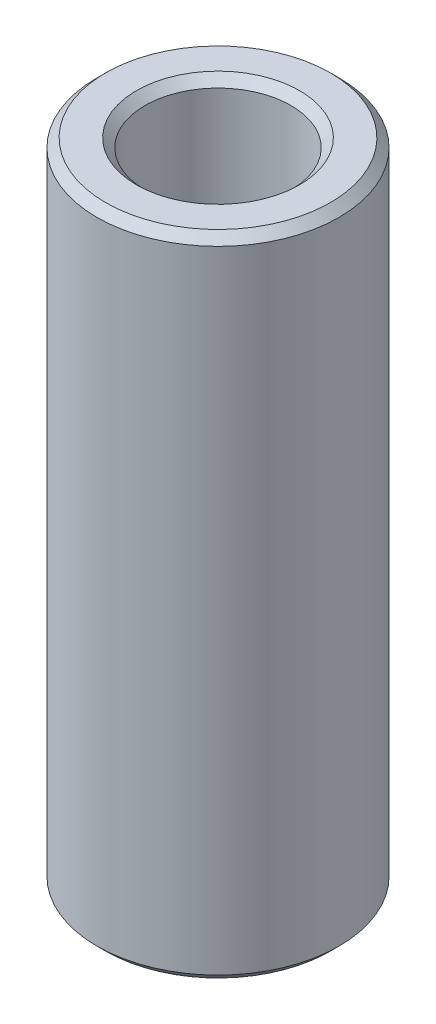
ISO-10303-21;
HEADER;
FILE_DESCRIPTION(('STEP AP214'),'2;1');
FILE_NAME('part.step','',(''),(''),'','','');
FILE_SCHEMA(('AUTOMOTIVE_DESIGN { 1 0 10303 214 1 1 1 1 }'));
ENDSEC;
DATA;
#1=APPLICATION_CONTEXT('core data for automotive mechanical design processes');
#2=APPLICATION_PROTOCOL_DEFINITION('international standard','automotive_design',2000,#1);
#3=PRODUCT_CONTEXT('',#1,'mechanical');
#4=PRODUCT('Part','Part','',(#3));
#5=PRODUCT_RELATED_PRODUCT_CATEGORY('part','',(#4));
#6=PRODUCT_DEFINITION_FORMATION('','',#4);
#7=PRODUCT_DEFINITION_CONTEXT('part definition',#1,'design');
#8=PRODUCT_DEFINITION('design','',#6,#7);
#9=PRODUCT_DEFINITION_SHAPE('','',#8);
#10=(LENGTH_UNIT() NAMED_UNIT(*) SI_UNIT(.MILLI.,.METRE.));
#11=(NAMED_UNIT(*) PLANE_ANGLE_UNIT() SI_UNIT($,.RADIAN.));
#12=(NAMED_UNIT(*) SI_UNIT($,.STERADIAN.) SOLID_ANGLE_UNIT());
#13=UNCERTAINTY_MEASURE_WITH_UNIT(LENGTH_MEASURE(1.E-05),#10,'distance_accuracy_value','');
#14=(GEOMETRIC_REPRESENTATION_CONTEXT(3) GLOBAL_UNCERTAINTY_ASSIGNED_CONTEXT((#13)) GLOBAL_UNIT_ASSIGNED_CONTEXT((#10,
#11,#12)) REPRESENTATION_CONTEXT('',''));
#15=CARTESIAN_POINT('',(0.,0.,0.));
#16=DIRECTION('',(0.,0.,1.));
#17=DIRECTION('',(1.,0.,0.));
#18=AXIS2_PLACEMENT_3D('',#15,#16,#17);
#19=CARTESIAN_POINT('',(0.,214.372509116879,0.));
#20=DIRECTION('',(0.,-1.,0.));
#21=DIRECTION('',(0.,0.,-1.));
#22=AXIS2_PLACEMENT_3D('',#19,#20,#21);
#23=CYLINDRICAL_SURFACE('',#22,40.);
#24=CARTESIAN_POINT('',(0.,2.83700859319602,0.));
#25=DIRECTION('',(0.,1.,0.));
#26=DIRECTION('',(0.,0.,1.));
#27=AXIS2_PLACEMENT_3D('',#24,#25,#26);
#28=CIRCLE('',#27,40.);
#29=CARTESIAN_POINT('',(0.,2.83700859319602,40.));
#30=VERTEX_POINT('',#29);
#31=EDGE_CURVE('E10',#30,#30,#28,.T.);
#32=ORIENTED_EDGE('',*,*,#31,.T.);
#33=EDGE_LOOP('',(#32));
#34=FACE_BOUND('',#33,.T.);
#35=CARTESIAN_POINT('',(0.,211.535500523683,0.));
#36=DIRECTION('',(0.,1.,0.));
#37=DIRECTION('',(0.,0.,1.));
#38=AXIS2_PLACEMENT_3D('',#35,#36,#37);
#39=CIRCLE('',#38,40.);
#40=CARTESIAN_POINT('',(0.,211.535500523683,40.));
#41=VERTEX_POINT('',#40);
#42=EDGE_CURVE('E50',#41,#41,#39,.F.);
#43=ORIENTED_EDGE('',*,*,#42,.T.);
#44=EDGE_LOOP('',(#43));
#45=FACE_BOUND('',#44,.T.);
#46=ADVANCED_FACE('F39',(#34,#45),#23,.T.);
#47=CARTESIAN_POINT('',(0.,214.372509116879,0.));
#48=DIRECTION('',(0.,1.,0.));
#49=DIRECTION('',(0.,0.,1.));
#50=AXIS2_PLACEMENT_3D('',#47,#48,#49);
#51=PLANE('',#50);
#52=CARTESIAN_POINT('',(0.,214.372509116879,0.));
#53=DIRECTION('',(0.,1.,0.));
#54=DIRECTION('',(0.,0.,1.));
#55=AXIS2_PLACEMENT_3D('',#52,#53,#54);
#56=CIRCLE('',#55,26.9860120434301);
#57=CARTESIAN_POINT('',(0.,214.372509116879,26.9860120434301));
#58=VERTEX_POINT('',#57);
#59=EDGE_CURVE('E58',#58,#58,#56,.F.);
#60=ORIENTED_EDGE('',*,*,#59,.T.);
#61=EDGE_LOOP('',(#60));
#62=FACE_BOUND('',#61,.T.);
#63=CARTESIAN_POINT('',(0.,214.372509116879,0.));
#64=DIRECTION('',(0.,1.,0.));
#65=DIRECTION('',(0.,0.,1.));
#66=AXIS2_PLACEMENT_3D('',#63,#64,#65);
#67=CIRCLE('',#66,37.162991406804);
#68=CARTESIAN_POINT('',(0.,214.372509116879,37.162991406804));
#69=VERTEX_POINT('',#68);
#70=EDGE_CURVE('E61',#69,#69,#67,.T.);
#71=ORIENTED_EDGE('',*,*,#70,.T.);
#72=EDGE_LOOP('',(#71));
#73=FACE_BOUND('',#72,.T.);
#74=ADVANCED_FACE('F88',(#62,#73),#51,.T.);
#75=CARTESIAN_POINT('',(0.,0.,0.));
#76=DIRECTION('',(0.,1.,0.));
#77=DIRECTION('',(0.,0.,1.));
#78=AXIS2_PLACEMENT_3D('',#75,#76,#77);
#79=PLANE('',#78);
#80=CARTESIAN_POINT('',(0.,0.,0.));
#81=DIRECTION('',(0.,1.,0.));
#82=DIRECTION('',(0.,0.,1.));
#83=AXIS2_PLACEMENT_3D('',#80,#81,#82);
#84=CIRCLE('',#83,26.9860120434301);
#85=CARTESIAN_POINT('',(0.,0.,26.9860120434301));
#86=VERTEX_POINT('',#85);
#87=EDGE_CURVE('E51',#86,#86,#84,.T.);
#88=ORIENTED_EDGE('',*,*,#87,.T.);
#89=EDGE_LOOP('',(#88));
#90=FACE_BOUND('',#89,.T.);
#91=CARTESIAN_POINT('',(0.,0.,0.));
#92=DIRECTION('',(0.,1.,0.));
#93=DIRECTION('',(0.,0.,1.));
#94=AXIS2_PLACEMENT_3D('',#91,#92,#93);
#95=CIRCLE('',#94,37.162991406804);
#96=CARTESIAN_POINT('',(0.,0.,37.162991406804));
#97=VERTEX_POINT('',#96);
#98=EDGE_CURVE('E54',#97,#97,#95,.F.);
#99=ORIENTED_EDGE('',*,*,#98,.T.);
#100=EDGE_LOOP('',(#99));
#101=FACE_BOUND('',#100,.T.);
#102=ADVANCED_FACE('F83',(#90,#101),#79,.F.);
#103=CARTESIAN_POINT('',(0.,214.372509116879,0.));
#104=DIRECTION('',(0.,-1.,0.));
#105=DIRECTION('',(0.,0.,-1.));
#106=AXIS2_PLACEMENT_3D('',#103,#104,#105);
#107=CYLINDRICAL_SURFACE('',#106,24.1490034502341);
#108=CARTESIAN_POINT('',(0.,211.535500523683,0.));
#109=DIRECTION('',(0.,1.,0.));
#110=DIRECTION('',(0.,0.,1.));
#111=AXIS2_PLACEMENT_3D('',#108,#109,#110);
#112=CIRCLE('',#111,24.1490034502341);
#113=CARTESIAN_POINT('',(0.,211.535500523683,24.1490034502341));
#114=VERTEX_POINT('',#113);
#115=EDGE_CURVE('E67',#114,#114,#112,.T.);
#116=ORIENTED_EDGE('',*,*,#115,.T.);
#117=EDGE_LOOP('',(#116));
#118=FACE_BOUND('',#117,.T.);
#119=CARTESIAN_POINT('',(0.,2.83700859319602,0.));
#120=DIRECTION('',(0.,1.,0.));
#121=DIRECTION('',(0.,0.,1.));
#122=AXIS2_PLACEMENT_3D('',#119,#120,#121);
#123=CIRCLE('',#122,24.1490034502341);
#124=CARTESIAN_POINT('',(0.,2.83700859319602,24.1490034502341));
#125=VERTEX_POINT('',#124);
#126=EDGE_CURVE('E69',#125,#125,#123,.F.);
#127=ORIENTED_EDGE('',*,*,#126,.T.);
#128=EDGE_LOOP('',(#127));
#129=FACE_BOUND('',#128,.T.);
#130=ADVANCED_FACE('F71',(#118,#129),#107,.F.);
#131=CARTESIAN_POINT('',(0.,211.535500523683,0.));
#132=DIRECTION('',(0.,1.,0.));
#133=DIRECTION('',(0.,0.,1.));
#134=AXIS2_PLACEMENT_3D('',#131,#132,#133);
#135=CONICAL_SURFACE('',#134,24.1490034502341,0.785398163397446);
#136=ORIENTED_EDGE('',*,*,#59,.F.);
#137=EDGE_LOOP('',(#136));
#138=FACE_BOUND('',#137,.T.);
#139=ORIENTED_EDGE('',*,*,#115,.F.);
#140=EDGE_LOOP('',(#139));
#141=FACE_BOUND('',#140,.T.);
#142=ADVANCED_FACE('F77',(#138,#141),#135,.F.);
#143=CARTESIAN_POINT('',(0.,0.,0.));
#144=DIRECTION('',(0.,-1.,0.));
#145=DIRECTION('',(0.,0.,-1.));
#146=AXIS2_PLACEMENT_3D('',#143,#144,#145);
#147=CONICAL_SURFACE('',#146,26.9860120434301,0.78539816339744);
#148=ORIENTED_EDGE('',*,*,#126,.F.);
#149=EDGE_LOOP('',(#148));
#150=FACE_BOUND('',#149,.T.);
#151=ORIENTED_EDGE('',*,*,#87,.F.);
#152=EDGE_LOOP('',(#151));
#153=FACE_BOUND('',#152,.T.);
#154=ADVANCED_FACE('F73',(#150,#153),#147,.F.);
#155=CARTESIAN_POINT('',(0.,2.83700859319602,0.));
#156=DIRECTION('',(0.,1.,0.));
#157=DIRECTION('',(0.,0.,1.));
#158=AXIS2_PLACEMENT_3D('',#155,#156,#157);
#159=CONICAL_SURFACE('',#158,40.,0.785398163397447);
#160=ORIENTED_EDGE('',*,*,#98,.F.);
#161=EDGE_LOOP('',(#160));
#162=FACE_BOUND('',#161,.T.);
#163=ORIENTED_EDGE('',*,*,#31,.F.);
#164=EDGE_LOOP('',(#163));
#165=FACE_BOUND('',#164,.T.);
#166=ADVANCED_FACE('F76',(#162,#165),#159,.T.);
#167=CARTESIAN_POINT('',(0.,214.372509116879,0.));
#168=DIRECTION('',(0.,-1.,0.));
#169=DIRECTION('',(0.,0.,-1.));
#170=AXIS2_PLACEMENT_3D('',#167,#168,#169);
#171=CONICAL_SURFACE('',#170,37.162991406804,0.785398163397452);
#172=ORIENTED_EDGE('',*,*,#42,.F.);
#173=EDGE_LOOP('',(#172));
#174=FACE_BOUND('',#173,.T.);
#175=ORIENTED_EDGE('',*,*,#70,.F.);
#176=EDGE_LOOP('',(#175));
#177=FACE_BOUND('',#176,.T.);
#178=ADVANCED_FACE('F45',(#174,#177),#171,.T.);
#179=CLOSED_SHELL('',(#46,#74,#102,#130,#142,#154,#166,#178));
#180=MANIFOLD_SOLID_BREP('B2',#179);
#181=ADVANCED_BREP_SHAPE_REPRESENTATION('',(#18,#180),#14);
#182=SHAPE_DEFINITION_REPRESENTATION(#9,#181);
ENDSEC;
END-ISO-10303-21;
